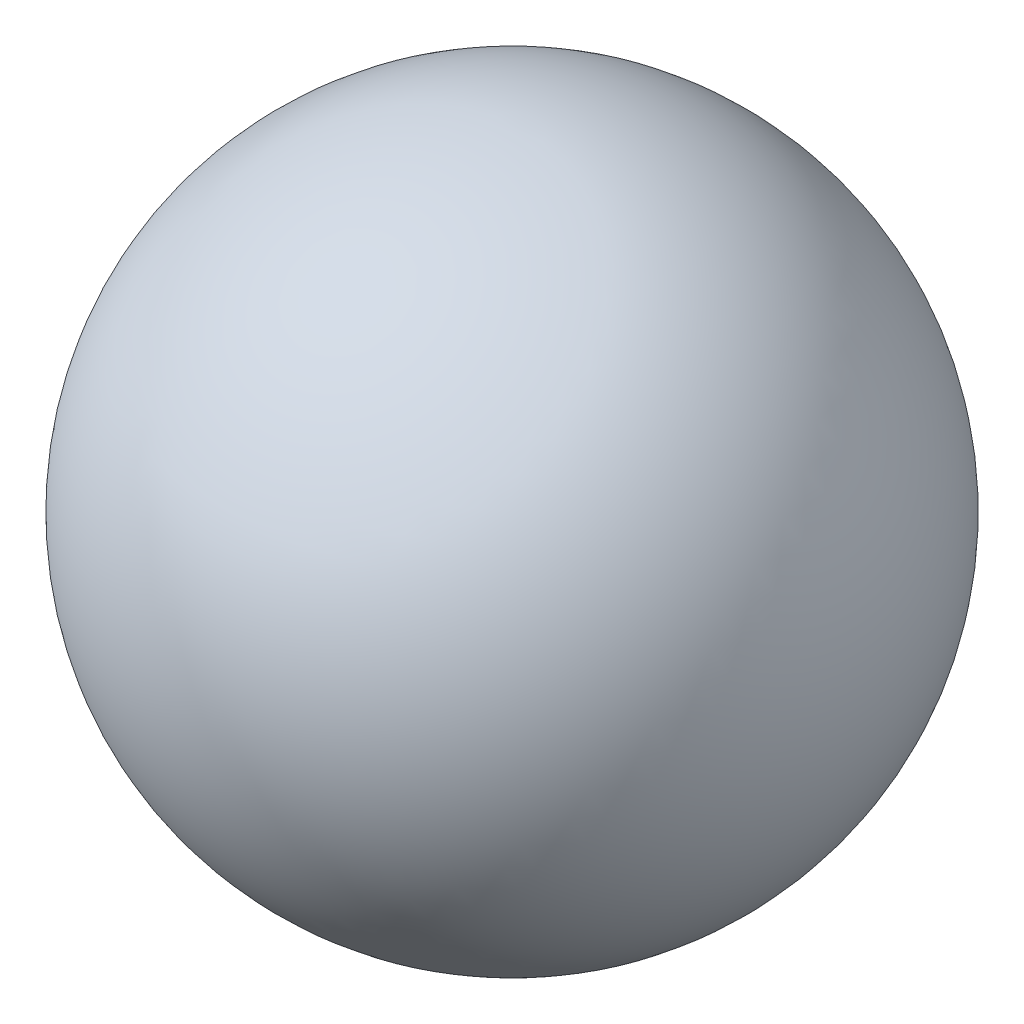
ISO-10303-21;
HEADER;
FILE_DESCRIPTION(('STEP AP214'),'2;1');
FILE_NAME('part.step','',(''),(''),'','','');
FILE_SCHEMA(('AUTOMOTIVE_DESIGN { 1 0 10303 214 1 1 1 1 }'));
ENDSEC;
DATA;
#1=APPLICATION_CONTEXT('core data for automotive mechanical design processes');
#2=APPLICATION_PROTOCOL_DEFINITION('international standard','automotive_design',2000,#1);
#3=PRODUCT_CONTEXT('',#1,'mechanical');
#4=PRODUCT('Part','Part','',(#3));
#5=PRODUCT_RELATED_PRODUCT_CATEGORY('part','',(#4));
#6=PRODUCT_DEFINITION_FORMATION('','',#4);
#7=PRODUCT_DEFINITION_CONTEXT('part definition',#1,'design');
#8=PRODUCT_DEFINITION('design','',#6,#7);
#9=PRODUCT_DEFINITION_SHAPE('','',#8);
#10=(LENGTH_UNIT() NAMED_UNIT(*) SI_UNIT(.MILLI.,.METRE.));
#11=(NAMED_UNIT(*) PLANE_ANGLE_UNIT() SI_UNIT($,.RADIAN.));
#12=(NAMED_UNIT(*) SI_UNIT($,.STERADIAN.) SOLID_ANGLE_UNIT());
#13=UNCERTAINTY_MEASURE_WITH_UNIT(LENGTH_MEASURE(1.E-05),#10,'distance_accuracy_value','');
#14=(GEOMETRIC_REPRESENTATION_CONTEXT(3) GLOBAL_UNCERTAINTY_ASSIGNED_CONTEXT((#13)) GLOBAL_UNIT_ASSIGNED_CONTEXT((#10,
#11,#12)) REPRESENTATION_CONTEXT('',''));
#15=CARTESIAN_POINT('',(0.,0.,0.));
#16=DIRECTION('',(0.,0.,1.));
#17=DIRECTION('',(1.,0.,0.));
#18=AXIS2_PLACEMENT_3D('',#15,#16,#17);
#19=CARTESIAN_POINT('',(0.,0.,0.));
#20=DIRECTION('',(0.,1.,0.));
#21=DIRECTION('',(1.,0.,0.));
#22=AXIS2_PLACEMENT_3D('',#19,#20,#21);
#23=SPHERICAL_SURFACE('',#22,3.575);
#24=CARTESIAN_POINT('',(0.,3.575,0.));
#25=VERTEX_POINT('',#24);
#26=VERTEX_LOOP('',#25);
#27=FACE_BOUND('',#26,.T.);
#28=ADVANCED_FACE('F26',(#27),#23,.T.);
#29=CLOSED_SHELL('',(#28));
#30=MANIFOLD_SOLID_BREP('B2',#29);
#31=ADVANCED_BREP_SHAPE_REPRESENTATION('',(#18,#30),#14);
#32=SHAPE_DEFINITION_REPRESENTATION(#9,#31);
ENDSEC;
END-ISO-10303-21;
